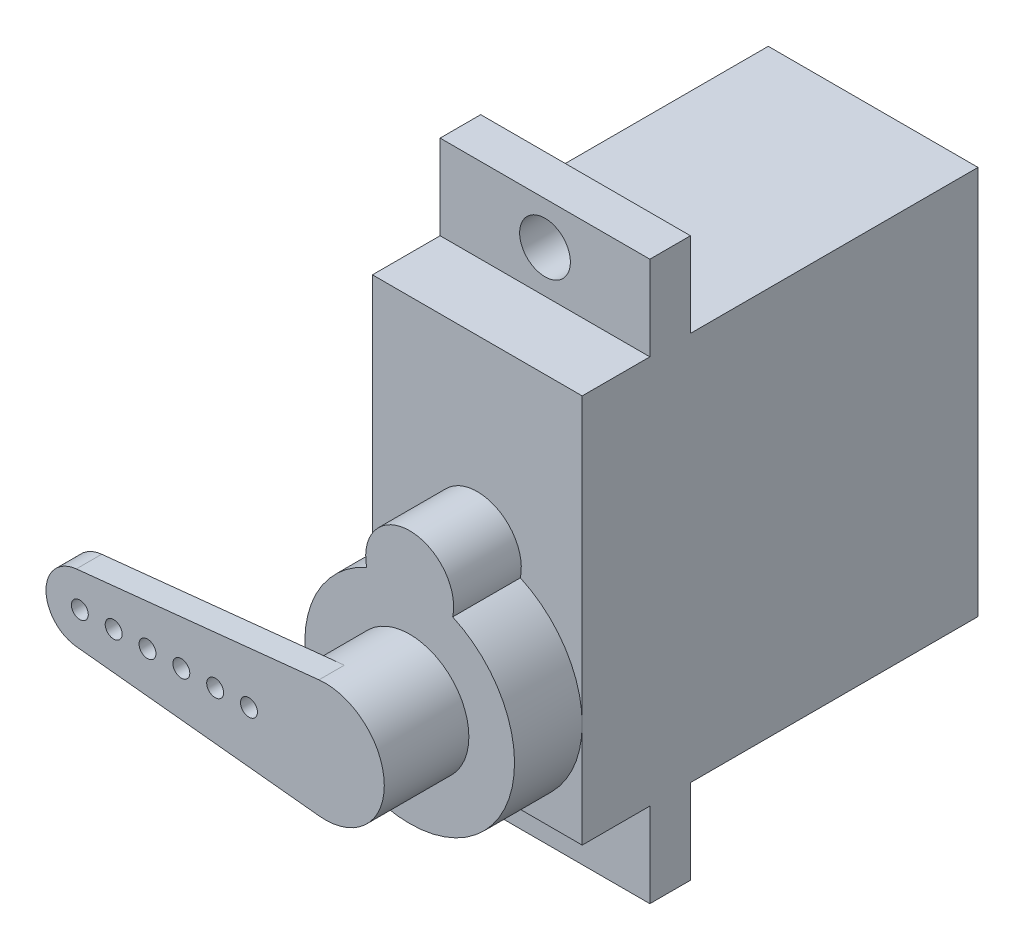
ISO-10303-21;
HEADER;
FILE_DESCRIPTION(('STEP AP214'),'2;1');
FILE_NAME('part.step','',(''),(''),'','','');
FILE_SCHEMA(('AUTOMOTIVE_DESIGN { 1 0 10303 214 1 1 1 1 }'));
ENDSEC;
DATA;
#1=APPLICATION_CONTEXT('core data for automotive mechanical design processes');
#2=APPLICATION_PROTOCOL_DEFINITION('international standard','automotive_design',2000,#1);
#3=PRODUCT_CONTEXT('',#1,'mechanical');
#4=PRODUCT('Part','Part','',(#3));
#5=PRODUCT_RELATED_PRODUCT_CATEGORY('part','',(#4));
#6=PRODUCT_DEFINITION_FORMATION('','',#4);
#7=PRODUCT_DEFINITION_CONTEXT('part definition',#1,'design');
#8=PRODUCT_DEFINITION('design','',#6,#7);
#9=PRODUCT_DEFINITION_SHAPE('','',#8);
#10=(LENGTH_UNIT() NAMED_UNIT(*) SI_UNIT(.MILLI.,.METRE.));
#11=(NAMED_UNIT(*) PLANE_ANGLE_UNIT() SI_UNIT($,.RADIAN.));
#12=(NAMED_UNIT(*) SI_UNIT($,.STERADIAN.) SOLID_ANGLE_UNIT());
#13=UNCERTAINTY_MEASURE_WITH_UNIT(LENGTH_MEASURE(1.E-05),#10,'distance_accuracy_value','');
#14=(GEOMETRIC_REPRESENTATION_CONTEXT(3) GLOBAL_UNCERTAINTY_ASSIGNED_CONTEXT((#13)) GLOBAL_UNIT_ASSIGNED_CONTEXT((#10,
#11,#12)) REPRESENTATION_CONTEXT('',''));
#15=CARTESIAN_POINT('',(0.,0.,0.));
#16=DIRECTION('',(0.,0.,1.));
#17=DIRECTION('',(1.,0.,0.));
#18=AXIS2_PLACEMENT_3D('',#15,#16,#17);
#19=CARTESIAN_POINT('',(6.2,11.5,0.));
#20=DIRECTION('',(0.,0.,1.));
#21=DIRECTION('',(1.,0.,0.));
#22=AXIS2_PLACEMENT_3D('',#19,#20,#21);
#23=PLANE('',#22);
#24=DIRECTION('',(0.,-1.,0.));
#25=VECTOR('',#24,1.);
#26=CARTESIAN_POINT('',(0.,23.,0.));
#27=LINE('',#26,#25);
#28=CARTESIAN_POINT('',(0.,23.,0.));
#29=VERTEX_POINT('',#28);
#30=CARTESIAN_POINT('',(0.,0.,0.));
#31=VERTEX_POINT('',#30);
#32=EDGE_CURVE('P0_E11',#29,#31,#27,.T.);
#33=ORIENTED_EDGE('',*,*,#32,.F.);
#34=DIRECTION('',(-1.,0.,0.));
#35=VECTOR('',#34,1.);
#36=CARTESIAN_POINT('',(12.4,23.,0.));
#37=LINE('',#36,#35);
#38=CARTESIAN_POINT('',(12.4,23.,0.));
#39=VERTEX_POINT('',#38);
#40=EDGE_CURVE('P0_E238',#39,#29,#37,.T.);
#41=ORIENTED_EDGE('',*,*,#40,.F.);
#42=DIRECTION('',(0.,1.,0.));
#43=VECTOR('',#42,1.);
#44=CARTESIAN_POINT('',(12.4,0.,0.));
#45=LINE('',#44,#43);
#46=CARTESIAN_POINT('',(12.4,0.,0.));
#47=VERTEX_POINT('',#46);
#48=EDGE_CURVE('P0_E352',#47,#39,#45,.T.);
#49=ORIENTED_EDGE('',*,*,#48,.F.);
#50=DIRECTION('',(1.,0.,0.));
#51=VECTOR('',#50,1.);
#52=CARTESIAN_POINT('',(0.,0.,0.));
#53=LINE('',#52,#51);
#54=EDGE_CURVE('P0_E43',#31,#47,#53,.T.);
#55=ORIENTED_EDGE('',*,*,#54,.F.);
#56=EDGE_LOOP('',(#33,#41,#49,#55));
#57=FACE_BOUND('',#56,.T.);
#58=ADVANCED_FACE('P0_F16',(#57),#23,.F.);
#59=CARTESIAN_POINT('',(0.,23.,0.));
#60=DIRECTION('',(-1.,0.,0.));
#61=DIRECTION('',(0.,0.,1.));
#62=AXIS2_PLACEMENT_3D('',#59,#60,#61);
#63=PLANE('',#62);
#64=ORIENTED_EDGE('',*,*,#32,.T.);
#65=DIRECTION('',(0.,0.,1.));
#66=VECTOR('',#65,1.);
#67=CARTESIAN_POINT('',(0.,0.,0.));
#68=LINE('',#67,#66);
#69=CARTESIAN_POINT('',(0.,0.,17.));
#70=VERTEX_POINT('',#69);
#71=EDGE_CURVE('P0_E24',#31,#70,#68,.T.);
#72=ORIENTED_EDGE('',*,*,#71,.T.);
#73=DIRECTION('',(0.,-1.,0.));
#74=VECTOR('',#73,1.);
#75=CARTESIAN_POINT('',(0.,23.,17.));
#76=LINE('',#75,#74);
#77=CARTESIAN_POINT('',(0.,-5.,17.));
#78=VERTEX_POINT('',#77);
#79=EDGE_CURVE('P0_E262',#70,#78,#76,.T.);
#80=ORIENTED_EDGE('',*,*,#79,.T.);
#81=DIRECTION('',(0.,0.,1.));
#82=VECTOR('',#81,1.);
#83=CARTESIAN_POINT('',(0.,-5.,17.));
#84=LINE('',#83,#82);
#85=CARTESIAN_POINT('',(0.,-5.,19.4));
#86=VERTEX_POINT('',#85);
#87=EDGE_CURVE('P0_E235',#78,#86,#84,.T.);
#88=ORIENTED_EDGE('',*,*,#87,.T.);
#89=DIRECTION('',(0.,-1.,0.));
#90=VECTOR('',#89,1.);
#91=CARTESIAN_POINT('',(0.,23.,19.4));
#92=LINE('',#91,#90);
#93=CARTESIAN_POINT('',(0.,0.,19.4));
#94=VERTEX_POINT('',#93);
#95=EDGE_CURVE('P0_E307',#94,#86,#92,.T.);
#96=ORIENTED_EDGE('',*,*,#95,.F.);
#97=DIRECTION('',(0.,0.,1.));
#98=VECTOR('',#97,1.);
#99=CARTESIAN_POINT('',(0.,0.,19.4));
#100=LINE('',#99,#98);
#101=CARTESIAN_POINT('',(0.,0.,23.4));
#102=VERTEX_POINT('',#101);
#103=EDGE_CURVE('P0_E294',#94,#102,#100,.T.);
#104=ORIENTED_EDGE('',*,*,#103,.T.);
#105=DIRECTION('',(0.,-1.,0.));
#106=VECTOR('',#105,1.);
#107=CARTESIAN_POINT('',(0.,23.,23.4));
#108=LINE('',#107,#106);
#109=CARTESIAN_POINT('',(0.,6.2,23.4));
#110=VERTEX_POINT('',#109);
#111=EDGE_CURVE('P0_E266',#110,#102,#108,.T.);
#112=ORIENTED_EDGE('',*,*,#111,.F.);
#113=DIRECTION('',(0.,-1.,0.));
#114=VECTOR('',#113,1.);
#115=CARTESIAN_POINT('',(0.,23.,23.4));
#116=LINE('',#115,#114);
#117=CARTESIAN_POINT('',(0.,23.,23.4));
#118=VERTEX_POINT('',#117);
#119=EDGE_CURVE('P0_E186',#118,#110,#116,.T.);
#120=ORIENTED_EDGE('',*,*,#119,.F.);
#121=DIRECTION('',(0.,0.,1.));
#122=VECTOR('',#121,1.);
#123=CARTESIAN_POINT('',(0.,23.,19.4));
#124=LINE('',#123,#122);
#125=CARTESIAN_POINT('',(0.,23.,19.4));
#126=VERTEX_POINT('',#125);
#127=EDGE_CURVE('P0_E281',#126,#118,#124,.T.);
#128=ORIENTED_EDGE('',*,*,#127,.F.);
#129=DIRECTION('',(0.,-1.,0.));
#130=VECTOR('',#129,1.);
#131=CARTESIAN_POINT('',(0.,23.,19.4));
#132=LINE('',#131,#130);
#133=CARTESIAN_POINT('',(0.,28.,19.4));
#134=VERTEX_POINT('',#133);
#135=EDGE_CURVE('P0_E304',#134,#126,#132,.T.);
#136=ORIENTED_EDGE('',*,*,#135,.F.);
#137=DIRECTION('',(0.,0.,1.));
#138=VECTOR('',#137,1.);
#139=CARTESIAN_POINT('',(0.,28.,17.));
#140=LINE('',#139,#138);
#141=CARTESIAN_POINT('',(0.,28.,17.));
#142=VERTEX_POINT('',#141);
#143=EDGE_CURVE('P0_E341',#142,#134,#140,.T.);
#144=ORIENTED_EDGE('',*,*,#143,.F.);
#145=DIRECTION('',(0.,-1.,0.));
#146=VECTOR('',#145,1.);
#147=CARTESIAN_POINT('',(0.,23.,17.));
#148=LINE('',#147,#146);
#149=CARTESIAN_POINT('',(0.,23.,17.));
#150=VERTEX_POINT('',#149);
#151=EDGE_CURVE('P0_E248',#142,#150,#148,.T.);
#152=ORIENTED_EDGE('',*,*,#151,.T.);
#153=DIRECTION('',(0.,0.,1.));
#154=VECTOR('',#153,1.);
#155=CARTESIAN_POINT('',(0.,23.,0.));
#156=LINE('',#155,#154);
#157=EDGE_CURVE('P0_E277',#29,#150,#156,.T.);
#158=ORIENTED_EDGE('',*,*,#157,.F.);
#159=EDGE_LOOP('',(#64,#72,#80,#88,#96,#104,#112,#120,#128,#136,#144,#152,#158));
#160=FACE_BOUND('',#159,.T.);
#161=ADVANCED_FACE('P0_F367',(#160),#63,.T.);
#162=CARTESIAN_POINT('',(0.,0.,0.));
#163=DIRECTION('',(0.,-1.,0.));
#164=DIRECTION('',(0.,0.,-1.));
#165=AXIS2_PLACEMENT_3D('',#162,#163,#164);
#166=PLANE('',#165);
#167=ORIENTED_EDGE('',*,*,#54,.T.);
#168=DIRECTION('',(0.,0.,1.));
#169=VECTOR('',#168,1.);
#170=CARTESIAN_POINT('',(12.4,0.,0.));
#171=LINE('',#170,#169);
#172=CARTESIAN_POINT('',(12.4,0.,17.));
#173=VERTEX_POINT('',#172);
#174=EDGE_CURVE('P0_E333',#47,#173,#171,.T.);
#175=ORIENTED_EDGE('',*,*,#174,.T.);
#176=DIRECTION('',(1.,0.,0.));
#177=VECTOR('',#176,1.);
#178=CARTESIAN_POINT('',(0.,0.,17.));
#179=LINE('',#178,#177);
#180=EDGE_CURVE('P0_E316',#70,#173,#179,.T.);
#181=ORIENTED_EDGE('',*,*,#180,.F.);
#182=ORIENTED_EDGE('',*,*,#71,.F.);
#183=EDGE_LOOP('',(#167,#175,#181,#182));
#184=FACE_BOUND('',#183,.T.);
#185=ADVANCED_FACE('P0_F357',(#184),#166,.T.);
#186=CARTESIAN_POINT('',(12.4,0.,0.));
#187=DIRECTION('',(1.,0.,0.));
#188=DIRECTION('',(0.,1.,0.));
#189=AXIS2_PLACEMENT_3D('',#186,#187,#188);
#190=PLANE('',#189);
#191=ORIENTED_EDGE('',*,*,#48,.T.);
#192=DIRECTION('',(0.,0.,1.));
#193=VECTOR('',#192,1.);
#194=CARTESIAN_POINT('',(12.4,23.,0.));
#195=LINE('',#194,#193);
#196=CARTESIAN_POINT('',(12.4,23.,17.));
#197=VERTEX_POINT('',#196);
#198=EDGE_CURVE('P0_E349',#39,#197,#195,.T.);
#199=ORIENTED_EDGE('',*,*,#198,.T.);
#200=DIRECTION('',(0.,1.,0.));
#201=VECTOR('',#200,1.);
#202=CARTESIAN_POINT('',(12.4,-5.,17.));
#203=LINE('',#202,#201);
#204=CARTESIAN_POINT('',(12.4,28.,17.));
#205=VERTEX_POINT('',#204);
#206=EDGE_CURVE('P0_E337',#197,#205,#203,.T.);
#207=ORIENTED_EDGE('',*,*,#206,.T.);
#208=DIRECTION('',(0.,0.,1.));
#209=VECTOR('',#208,1.);
#210=CARTESIAN_POINT('',(12.4,28.,17.));
#211=LINE('',#210,#209);
#212=CARTESIAN_POINT('',(12.4,28.,19.4));
#213=VERTEX_POINT('',#212);
#214=EDGE_CURVE('P0_E344',#205,#213,#211,.T.);
#215=ORIENTED_EDGE('',*,*,#214,.T.);
#216=DIRECTION('',(0.,1.,0.));
#217=VECTOR('',#216,1.);
#218=CARTESIAN_POINT('',(12.4,-5.,19.4));
#219=LINE('',#218,#217);
#220=CARTESIAN_POINT('',(12.4,23.,19.4));
#221=VERTEX_POINT('',#220);
#222=EDGE_CURVE('P0_E297',#221,#213,#219,.T.);
#223=ORIENTED_EDGE('',*,*,#222,.F.);
#224=DIRECTION('',(0.,0.,1.));
#225=VECTOR('',#224,1.);
#226=CARTESIAN_POINT('',(12.4,23.,19.4));
#227=LINE('',#226,#225);
#228=CARTESIAN_POINT('',(12.4,23.,23.4));
#229=VERTEX_POINT('',#228);
#230=EDGE_CURVE('P0_E284',#221,#229,#227,.T.);
#231=ORIENTED_EDGE('',*,*,#230,.T.);
#232=DIRECTION('',(0.,1.,0.));
#233=VECTOR('',#232,1.);
#234=CARTESIAN_POINT('',(12.4,0.,23.4));
#235=LINE('',#234,#233);
#236=CARTESIAN_POINT('',(12.4,6.2,23.4));
#237=VERTEX_POINT('',#236);
#238=EDGE_CURVE('P0_E225',#237,#229,#235,.T.);
#239=ORIENTED_EDGE('',*,*,#238,.F.);
#240=DIRECTION('',(0.,1.,0.));
#241=VECTOR('',#240,1.);
#242=CARTESIAN_POINT('',(12.4,0.,23.4));
#243=LINE('',#242,#241);
#244=CARTESIAN_POINT('',(12.4,0.,23.4));
#245=VERTEX_POINT('',#244);
#246=EDGE_CURVE('P0_E257',#245,#237,#243,.T.);
#247=ORIENTED_EDGE('',*,*,#246,.F.);
#248=DIRECTION('',(0.,0.,1.));
#249=VECTOR('',#248,1.);
#250=CARTESIAN_POINT('',(12.4,0.,19.4));
#251=LINE('',#250,#249);
#252=CARTESIAN_POINT('',(12.4,0.,19.4));
#253=VERTEX_POINT('',#252);
#254=EDGE_CURVE('P0_E291',#253,#245,#251,.T.);
#255=ORIENTED_EDGE('',*,*,#254,.F.);
#256=DIRECTION('',(0.,1.,0.));
#257=VECTOR('',#256,1.);
#258=CARTESIAN_POINT('',(12.4,-5.,19.4));
#259=LINE('',#258,#257);
#260=CARTESIAN_POINT('',(12.4,-5.,19.4));
#261=VERTEX_POINT('',#260);
#262=EDGE_CURVE('P0_E315',#261,#253,#259,.T.);
#263=ORIENTED_EDGE('',*,*,#262,.F.);
#264=DIRECTION('',(0.,0.,1.));
#265=VECTOR('',#264,1.);
#266=CARTESIAN_POINT('',(12.4,-5.,17.));
#267=LINE('',#266,#265);
#268=CARTESIAN_POINT('',(12.4,-5.,17.));
#269=VERTEX_POINT('',#268);
#270=EDGE_CURVE('P0_E239',#269,#261,#267,.T.);
#271=ORIENTED_EDGE('',*,*,#270,.F.);
#272=DIRECTION('',(0.,1.,0.));
#273=VECTOR('',#272,1.);
#274=CARTESIAN_POINT('',(12.4,-5.,17.));
#275=LINE('',#274,#273);
#276=EDGE_CURVE('P0_E263',#269,#173,#275,.T.);
#277=ORIENTED_EDGE('',*,*,#276,.T.);
#278=ORIENTED_EDGE('',*,*,#174,.F.);
#279=EDGE_LOOP('',(#191,#199,#207,#215,#223,#231,#239,#247,#255,#263,#271,#277,#278));
#280=FACE_BOUND('',#279,.T.);
#281=ADVANCED_FACE('P0_F361',(#280),#190,.T.);
#282=CARTESIAN_POINT('',(12.4,23.,0.));
#283=DIRECTION('',(0.,1.,0.));
#284=DIRECTION('',(1.,0.,0.));
#285=AXIS2_PLACEMENT_3D('',#282,#283,#284);
#286=PLANE('',#285);
#287=ORIENTED_EDGE('',*,*,#40,.T.);
#288=ORIENTED_EDGE('',*,*,#157,.T.);
#289=DIRECTION('',(-1.,0.,0.));
#290=VECTOR('',#289,1.);
#291=CARTESIAN_POINT('',(12.4,23.,17.));
#292=LINE('',#291,#290);
#293=EDGE_CURVE('P0_E253',#197,#150,#292,.T.);
#294=ORIENTED_EDGE('',*,*,#293,.F.);
#295=ORIENTED_EDGE('',*,*,#198,.F.);
#296=EDGE_LOOP('',(#287,#288,#294,#295));
#297=FACE_BOUND('',#296,.T.);
#298=ADVANCED_FACE('P0_F375',(#297),#286,.T.);
#299=CARTESIAN_POINT('',(0.,-5.,17.));
#300=DIRECTION('',(0.,-1.,0.));
#301=DIRECTION('',(0.,0.,-1.));
#302=AXIS2_PLACEMENT_3D('',#299,#300,#301);
#303=PLANE('',#302);
#304=DIRECTION('',(1.,0.,0.));
#305=VECTOR('',#304,1.);
#306=CARTESIAN_POINT('',(0.,-5.,17.));
#307=LINE('',#306,#305);
#308=EDGE_CURVE('P0_E258',#78,#269,#307,.T.);
#309=ORIENTED_EDGE('',*,*,#308,.T.);
#310=ORIENTED_EDGE('',*,*,#270,.T.);
#311=DIRECTION('',(1.,0.,0.));
#312=VECTOR('',#311,1.);
#313=CARTESIAN_POINT('',(0.,-5.,19.4));
#314=LINE('',#313,#312);
#315=EDGE_CURVE('P0_E311',#86,#261,#314,.T.);
#316=ORIENTED_EDGE('',*,*,#315,.F.);
#317=ORIENTED_EDGE('',*,*,#87,.F.);
#318=EDGE_LOOP('',(#309,#310,#316,#317));
#319=FACE_BOUND('',#318,.T.);
#320=ADVANCED_FACE('P0_F448',(#319),#303,.T.);
#321=CARTESIAN_POINT('',(12.4,28.,17.));
#322=DIRECTION('',(0.,1.,0.));
#323=DIRECTION('',(1.,0.,0.));
#324=AXIS2_PLACEMENT_3D('',#321,#322,#323);
#325=PLANE('',#324);
#326=DIRECTION('',(1.,0.,0.));
#327=VECTOR('',#326,1.);
#328=CARTESIAN_POINT('',(0.,28.,17.));
#329=LINE('',#328,#327);
#330=EDGE_CURVE('P0_E252',#142,#205,#329,.T.);
#331=ORIENTED_EDGE('',*,*,#330,.F.);
#332=ORIENTED_EDGE('',*,*,#143,.T.);
#333=DIRECTION('',(-1.,0.,0.));
#334=VECTOR('',#333,1.);
#335=CARTESIAN_POINT('',(0.,28.,19.4));
#336=LINE('',#335,#334);
#337=EDGE_CURVE('P0_E301',#213,#134,#336,.T.);
#338=ORIENTED_EDGE('',*,*,#337,.F.);
#339=ORIENTED_EDGE('',*,*,#214,.F.);
#340=EDGE_LOOP('',(#331,#332,#338,#339));
#341=FACE_BOUND('',#340,.T.);
#342=ADVANCED_FACE('P0_F386',(#341),#325,.T.);
#343=CARTESIAN_POINT('',(6.2,11.5,17.));
#344=DIRECTION('',(0.,0.,1.));
#345=DIRECTION('',(1.,0.,0.));
#346=AXIS2_PLACEMENT_3D('',#343,#344,#345);
#347=PLANE('',#346);
#348=CARTESIAN_POINT('',(6.2,25.5,17.));
#349=DIRECTION('',(0.,0.,1.));
#350=DIRECTION('',(1.,0.,0.));
#351=AXIS2_PLACEMENT_3D('',#348,#349,#350);
#352=CIRCLE('',#351,1.5);
#353=CARTESIAN_POINT('',(4.7,25.5,17.));
#354=VERTEX_POINT('',#353);
#355=EDGE_CURVE('P0_E206',#354,#354,#352,.T.);
#356=ORIENTED_EDGE('',*,*,#355,.T.);
#357=EDGE_LOOP('',(#356));
#358=FACE_BOUND('',#357,.T.);
#359=ORIENTED_EDGE('',*,*,#293,.T.);
#360=ORIENTED_EDGE('',*,*,#151,.F.);
#361=ORIENTED_EDGE('',*,*,#330,.T.);
#362=ORIENTED_EDGE('',*,*,#206,.F.);
#363=EDGE_LOOP('',(#359,#360,#361,#362));
#364=FACE_BOUND('',#363,.T.);
#365=ADVANCED_FACE('P0_F378',(#358,#364),#347,.F.);
#366=CARTESIAN_POINT('',(6.2,11.5,17.));
#367=DIRECTION('',(0.,0.,1.));
#368=DIRECTION('',(1.,0.,0.));
#369=AXIS2_PLACEMENT_3D('',#366,#367,#368);
#370=PLANE('',#369);
#371=CARTESIAN_POINT('',(6.2,-2.5,17.));
#372=DIRECTION('',(0.,0.,1.));
#373=DIRECTION('',(1.,0.,0.));
#374=AXIS2_PLACEMENT_3D('',#371,#372,#373);
#375=CIRCLE('',#374,1.5);
#376=CARTESIAN_POINT('',(4.7,-2.5,17.));
#377=VERTEX_POINT('',#376);
#378=EDGE_CURVE('P0_E404',#377,#377,#375,.T.);
#379=ORIENTED_EDGE('',*,*,#378,.T.);
#380=EDGE_LOOP('',(#379));
#381=FACE_BOUND('',#380,.T.);
#382=ORIENTED_EDGE('',*,*,#180,.T.);
#383=ORIENTED_EDGE('',*,*,#276,.F.);
#384=ORIENTED_EDGE('',*,*,#308,.F.);
#385=ORIENTED_EDGE('',*,*,#79,.F.);
#386=EDGE_LOOP('',(#382,#383,#384,#385));
#387=FACE_BOUND('',#386,.T.);
#388=ADVANCED_FACE('P0_F366',(#381,#387),#370,.F.);
#389=CARTESIAN_POINT('',(6.2,11.5,19.4));
#390=DIRECTION('',(0.,0.,1.));
#391=DIRECTION('',(1.,0.,0.));
#392=AXIS2_PLACEMENT_3D('',#389,#390,#391);
#393=PLANE('',#392);
#394=CARTESIAN_POINT('',(6.2,-2.5,19.4));
#395=DIRECTION('',(0.,0.,-1.));
#396=DIRECTION('',(1.,0.,0.));
#397=AXIS2_PLACEMENT_3D('',#394,#395,#396);
#398=CIRCLE('',#397,1.5);
#399=CARTESIAN_POINT('',(4.7,-2.5,19.4));
#400=VERTEX_POINT('',#399);
#401=EDGE_CURVE('P0_E410',#400,#400,#398,.T.);
#402=ORIENTED_EDGE('',*,*,#401,.T.);
#403=EDGE_LOOP('',(#402));
#404=FACE_BOUND('',#403,.T.);
#405=DIRECTION('',(-1.,0.,0.));
#406=VECTOR('',#405,1.);
#407=CARTESIAN_POINT('',(3.1,0.,19.4));
#408=LINE('',#407,#406);
#409=EDGE_CURVE('P0_E287',#253,#94,#408,.T.);
#410=ORIENTED_EDGE('',*,*,#409,.T.);
#411=ORIENTED_EDGE('',*,*,#95,.T.);
#412=ORIENTED_EDGE('',*,*,#315,.T.);
#413=ORIENTED_EDGE('',*,*,#262,.T.);
#414=EDGE_LOOP('',(#410,#411,#412,#413));
#415=FACE_BOUND('',#414,.T.);
#416=ADVANCED_FACE('P0_F419',(#404,#415),#393,.T.);
#417=CARTESIAN_POINT('',(6.2,11.5,19.4));
#418=DIRECTION('',(0.,0.,1.));
#419=DIRECTION('',(1.,0.,0.));
#420=AXIS2_PLACEMENT_3D('',#417,#418,#419);
#421=PLANE('',#420);
#422=CARTESIAN_POINT('',(6.2,25.5,19.4));
#423=DIRECTION('',(0.,0.,-1.));
#424=DIRECTION('',(1.,0.,0.));
#425=AXIS2_PLACEMENT_3D('',#422,#423,#424);
#426=CIRCLE('',#425,1.5);
#427=CARTESIAN_POINT('',(4.7,25.5,19.4));
#428=VERTEX_POINT('',#427);
#429=EDGE_CURVE('P0_E215',#428,#428,#426,.T.);
#430=ORIENTED_EDGE('',*,*,#429,.T.);
#431=EDGE_LOOP('',(#430));
#432=FACE_BOUND('',#431,.T.);
#433=DIRECTION('',(1.,0.,0.));
#434=VECTOR('',#433,1.);
#435=CARTESIAN_POINT('',(9.3,23.,19.4));
#436=LINE('',#435,#434);
#437=EDGE_CURVE('P0_E273',#126,#221,#436,.T.);
#438=ORIENTED_EDGE('',*,*,#437,.T.);
#439=ORIENTED_EDGE('',*,*,#222,.T.);
#440=ORIENTED_EDGE('',*,*,#337,.T.);
#441=ORIENTED_EDGE('',*,*,#135,.T.);
#442=EDGE_LOOP('',(#438,#439,#440,#441));
#443=FACE_BOUND('',#442,.T.);
#444=ADVANCED_FACE('P0_F390',(#432,#443),#421,.T.);
#445=CARTESIAN_POINT('',(0.,0.,19.4));
#446=DIRECTION('',(0.,-1.,0.));
#447=DIRECTION('',(0.,0.,-1.));
#448=AXIS2_PLACEMENT_3D('',#445,#446,#447);
#449=PLANE('',#448);
#450=ORIENTED_EDGE('',*,*,#409,.F.);
#451=ORIENTED_EDGE('',*,*,#254,.T.);
#452=DIRECTION('',(1.,0.,0.));
#453=VECTOR('',#452,1.);
#454=CARTESIAN_POINT('',(0.,0.,23.4));
#455=LINE('',#454,#453);
#456=CARTESIAN_POINT('',(6.2,0.,23.4));
#457=VERTEX_POINT('',#456);
#458=EDGE_CURVE('P0_E247',#457,#245,#455,.T.);
#459=ORIENTED_EDGE('',*,*,#458,.F.);
#460=DIRECTION('',(1.,0.,0.));
#461=VECTOR('',#460,1.);
#462=CARTESIAN_POINT('',(0.,0.,23.4));
#463=LINE('',#462,#461);
#464=EDGE_CURVE('P0_E270',#102,#457,#463,.T.);
#465=ORIENTED_EDGE('',*,*,#464,.F.);
#466=ORIENTED_EDGE('',*,*,#103,.F.);
#467=EDGE_LOOP('',(#450,#451,#459,#465,#466));
#468=FACE_BOUND('',#467,.T.);
#469=ADVANCED_FACE('P0_F452',(#468),#449,.T.);
#470=CARTESIAN_POINT('',(12.4,23.,19.4));
#471=DIRECTION('',(0.,1.,0.));
#472=DIRECTION('',(1.,0.,0.));
#473=AXIS2_PLACEMENT_3D('',#470,#471,#472);
#474=PLANE('',#473);
#475=ORIENTED_EDGE('',*,*,#437,.F.);
#476=ORIENTED_EDGE('',*,*,#127,.T.);
#477=DIRECTION('',(-1.,0.,0.));
#478=VECTOR('',#477,1.);
#479=CARTESIAN_POINT('',(12.4,23.,23.4));
#480=LINE('',#479,#478);
#481=EDGE_CURVE('P0_E229',#229,#118,#480,.T.);
#482=ORIENTED_EDGE('',*,*,#481,.F.);
#483=ORIENTED_EDGE('',*,*,#230,.F.);
#484=EDGE_LOOP('',(#475,#476,#482,#483));
#485=FACE_BOUND('',#484,.T.);
#486=ADVANCED_FACE('P0_F394',(#485),#474,.T.);
#487=CARTESIAN_POINT('',(6.2,11.5,23.4));
#488=DIRECTION('',(0.,0.,1.));
#489=DIRECTION('',(1.,0.,0.));
#490=AXIS2_PLACEMENT_3D('',#487,#488,#489);
#491=PLANE('',#490);
#492=CARTESIAN_POINT('',(6.2,6.2,23.4));
#493=DIRECTION('',(0.,0.,-1.));
#494=DIRECTION('',(-1.,0.,0.));
#495=AXIS2_PLACEMENT_3D('',#492,#493,#494);
#496=CIRCLE('',#495,6.2);
#497=EDGE_CURVE('P0_E234',#457,#110,#496,.T.);
#498=ORIENTED_EDGE('',*,*,#497,.T.);
#499=ORIENTED_EDGE('',*,*,#111,.T.);
#500=ORIENTED_EDGE('',*,*,#464,.T.);
#501=EDGE_LOOP('',(#498,#499,#500));
#502=FACE_BOUND('',#501,.T.);
#503=ADVANCED_FACE('P0_F456',(#502),#491,.T.);
#504=CARTESIAN_POINT('',(6.2,11.5,23.4));
#505=DIRECTION('',(0.,0.,1.));
#506=DIRECTION('',(1.,0.,0.));
#507=AXIS2_PLACEMENT_3D('',#504,#505,#506);
#508=PLANE('',#507);
#509=CARTESIAN_POINT('',(6.2,6.2,23.4));
#510=DIRECTION('',(0.,0.,-1.));
#511=DIRECTION('',(-1.,0.,0.));
#512=AXIS2_PLACEMENT_3D('',#509,#510,#511);
#513=CIRCLE('',#512,6.2);
#514=EDGE_CURVE('P0_E243',#237,#457,#513,.T.);
#515=ORIENTED_EDGE('',*,*,#514,.T.);
#516=ORIENTED_EDGE('',*,*,#458,.T.);
#517=ORIENTED_EDGE('',*,*,#246,.T.);
#518=EDGE_LOOP('',(#515,#516,#517));
#519=FACE_BOUND('',#518,.T.);
#520=ADVANCED_FACE('P0_F459',(#519),#508,.T.);
#521=CARTESIAN_POINT('',(6.2,6.2,27.4));
#522=DIRECTION('',(0.,0.,1.));
#523=DIRECTION('',(1.,0.,0.));
#524=AXIS2_PLACEMENT_3D('',#521,#522,#523);
#525=PLANE('',#524);
#526=CARTESIAN_POINT('',(6.2,6.2,27.4));
#527=DIRECTION('',(0.,0.,1.));
#528=DIRECTION('',(-1.,0.,0.));
#529=AXIS2_PLACEMENT_3D('',#526,#527,#528);
#530=CIRCLE('',#529,6.2);
#531=CARTESIAN_POINT('',(3.65779639534246,11.8548387096774,27.4));
#532=VERTEX_POINT('',#531);
#533=CARTESIAN_POINT('',(8.74220360465755,11.8548387096774,27.4));
#534=VERTEX_POINT('',#533);
#535=EDGE_CURVE('P0_E190',#532,#534,#530,.T.);
#536=ORIENTED_EDGE('',*,*,#535,.T.);
#537=CARTESIAN_POINT('',(6.2,12.4,27.4));
#538=DIRECTION('',(0.,0.,1.));
#539=DIRECTION('',(-1.,0.,0.));
#540=AXIS2_PLACEMENT_3D('',#537,#538,#539);
#541=CIRCLE('',#540,2.6);
#542=EDGE_CURVE('P0_E200',#534,#532,#541,.T.);
#543=ORIENTED_EDGE('',*,*,#542,.T.);
#544=EDGE_LOOP('',(#536,#543));
#545=FACE_BOUND('',#544,.T.);
#546=ADVANCED_FACE('P0_F466',(#545),#525,.T.);
#547=CARTESIAN_POINT('',(6.2,6.2,23.4));
#548=DIRECTION('',(0.,0.,1.));
#549=DIRECTION('',(0.,-1.,0.));
#550=AXIS2_PLACEMENT_3D('',#547,#548,#549);
#551=CYLINDRICAL_SURFACE('',#550,6.2);
#552=DIRECTION('',(0.,0.,1.));
#553=VECTOR('',#552,1.);
#554=CARTESIAN_POINT('',(8.74220360465755,11.8548387096774,23.4));
#555=LINE('',#554,#553);
#556=CARTESIAN_POINT('',(8.74220360465755,11.8548387096774,23.4));
#557=VERTEX_POINT('',#556);
#558=EDGE_CURVE('P0_E204',#557,#534,#555,.T.);
#559=ORIENTED_EDGE('',*,*,#558,.T.);
#560=ORIENTED_EDGE('',*,*,#535,.F.);
#561=DIRECTION('',(0.,0.,-1.));
#562=VECTOR('',#561,1.);
#563=CARTESIAN_POINT('',(3.65779639534246,11.8548387096774,23.4));
#564=LINE('',#563,#562);
#565=CARTESIAN_POINT('',(3.65779639534246,11.8548387096774,23.4));
#566=VERTEX_POINT('',#565);
#567=EDGE_CURVE('P0_E193',#532,#566,#564,.T.);
#568=ORIENTED_EDGE('',*,*,#567,.T.);
#569=CARTESIAN_POINT('',(6.2,6.2,23.4));
#570=DIRECTION('',(0.,0.,-1.));
#571=DIRECTION('',(-1.,0.,0.));
#572=AXIS2_PLACEMENT_3D('',#569,#570,#571);
#573=CIRCLE('',#572,6.2);
#574=EDGE_CURVE('P0_E178',#110,#566,#573,.T.);
#575=ORIENTED_EDGE('',*,*,#574,.F.);
#576=ORIENTED_EDGE('',*,*,#497,.F.);
#577=ORIENTED_EDGE('',*,*,#514,.F.);
#578=CARTESIAN_POINT('',(6.2,6.2,23.4));
#579=DIRECTION('',(0.,0.,-1.));
#580=DIRECTION('',(-1.,0.,0.));
#581=AXIS2_PLACEMENT_3D('',#578,#579,#580);
#582=CIRCLE('',#581,6.2);
#583=EDGE_CURVE('P0_E223',#557,#237,#582,.T.);
#584=ORIENTED_EDGE('',*,*,#583,.F.);
#585=EDGE_LOOP('',(#559,#560,#568,#575,#576,#577,#584));
#586=FACE_BOUND('',#585,.T.);
#587=ADVANCED_FACE('P0_F195',(#586),#551,.T.);
#588=CARTESIAN_POINT('',(6.2,11.5,23.4));
#589=DIRECTION('',(0.,0.,1.));
#590=DIRECTION('',(1.,0.,0.));
#591=AXIS2_PLACEMENT_3D('',#588,#589,#590);
#592=PLANE('',#591);
#593=CARTESIAN_POINT('',(6.2,12.4,23.4));
#594=DIRECTION('',(0.,0.,-1.));
#595=DIRECTION('',(-1.,0.,0.));
#596=AXIS2_PLACEMENT_3D('',#593,#594,#595);
#597=CIRCLE('',#596,2.6);
#598=EDGE_CURVE('P0_E183',#566,#557,#597,.T.);
#599=ORIENTED_EDGE('',*,*,#598,.T.);
#600=ORIENTED_EDGE('',*,*,#583,.T.);
#601=ORIENTED_EDGE('',*,*,#238,.T.);
#602=ORIENTED_EDGE('',*,*,#481,.T.);
#603=ORIENTED_EDGE('',*,*,#119,.T.);
#604=ORIENTED_EDGE('',*,*,#574,.T.);
#605=EDGE_LOOP('',(#599,#600,#601,#602,#603,#604));
#606=FACE_BOUND('',#605,.T.);
#607=ADVANCED_FACE('P0_F180',(#606),#592,.T.);
#608=CARTESIAN_POINT('',(6.2,12.4,23.4));
#609=DIRECTION('',(0.,0.,1.));
#610=DIRECTION('',(0.,1.,0.));
#611=AXIS2_PLACEMENT_3D('',#608,#609,#610);
#612=CYLINDRICAL_SURFACE('',#611,2.6);
#613=ORIENTED_EDGE('',*,*,#598,.F.);
#614=ORIENTED_EDGE('',*,*,#567,.F.);
#615=ORIENTED_EDGE('',*,*,#542,.F.);
#616=ORIENTED_EDGE('',*,*,#558,.F.);
#617=EDGE_LOOP('',(#613,#614,#615,#616));
#618=FACE_BOUND('',#617,.T.);
#619=ADVANCED_FACE('P0_F203',(#618),#612,.T.);
#620=CARTESIAN_POINT('',(6.2,25.5,18.08));
#621=DIRECTION('',(0.,0.,-1.));
#622=DIRECTION('',(1.,0.,0.));
#623=AXIS2_PLACEMENT_3D('',#620,#621,#622);
#624=CYLINDRICAL_SURFACE('',#623,1.5);
#625=ORIENTED_EDGE('',*,*,#429,.F.);
#626=DIRECTION('',(0.,0.,-1.));
#627=VECTOR('',#626,1.);
#628=CARTESIAN_POINT('',(4.7,25.5,18.08));
#629=LINE('',#628,#627);
#630=EDGE_CURVE('P0_E211',#428,#354,#629,.T.);
#631=ORIENTED_EDGE('',*,*,#630,.T.);
#632=ORIENTED_EDGE('',*,*,#355,.F.);
#633=ORIENTED_EDGE('',*,*,#630,.F.);
#634=EDGE_LOOP('',(#625,#631,#632,#633));
#635=FACE_BOUND('',#634,.T.);
#636=ADVANCED_FACE('P0_F477',(#635),#624,.F.);
#637=CARTESIAN_POINT('',(6.2,-2.5,18.08));
#638=DIRECTION('',(0.,0.,-1.));
#639=DIRECTION('',(1.,0.,0.));
#640=AXIS2_PLACEMENT_3D('',#637,#638,#639);
#641=CYLINDRICAL_SURFACE('',#640,1.5);
#642=ORIENTED_EDGE('',*,*,#401,.F.);
#643=DIRECTION('',(0.,0.,-1.));
#644=VECTOR('',#643,1.);
#645=CARTESIAN_POINT('',(4.7,-2.5,18.08));
#646=LINE('',#645,#644);
#647=EDGE_CURVE('P0_E407',#400,#377,#646,.T.);
#648=ORIENTED_EDGE('',*,*,#647,.T.);
#649=ORIENTED_EDGE('',*,*,#378,.F.);
#650=ORIENTED_EDGE('',*,*,#647,.F.);
#651=EDGE_LOOP('',(#642,#648,#649,#650));
#652=FACE_BOUND('',#651,.T.);
#653=ADVANCED_FACE('P0_F422',(#652),#641,.F.);
#654=CLOSED_SHELL('',(#58,#161,#185,#281,#298,#320,#342,#365,#388,#416,#444,#469,#486,#503,#520,
#546,#587,#607,#619,#636,#653));
#655=MANIFOLD_SOLID_BREP('P0_B1',#654);
#656=CARTESIAN_POINT('',(6.2,6.2,27.4));
#657=DIRECTION('',(0.,0.,1.));
#658=DIRECTION('',(1.,0.,0.));
#659=AXIS2_PLACEMENT_3D('',#656,#657,#658);
#660=PLANE('',#659);
#661=CARTESIAN_POINT('',(6.2,6.2,27.4));
#662=DIRECTION('',(0.,0.,1.));
#663=DIRECTION('',(-1.,0.,0.));
#664=AXIS2_PLACEMENT_3D('',#661,#662,#663);
#665=CIRCLE('',#664,3.5);
#666=CARTESIAN_POINT('',(9.7,6.2,27.4));
#667=VERTEX_POINT('',#666);
#668=EDGE_CURVE('P1_E25',#667,#667,#665,.T.);
#669=ORIENTED_EDGE('',*,*,#668,.F.);
#670=EDGE_LOOP('',(#669));
#671=FACE_BOUND('',#670,.T.);
#672=ADVANCED_FACE('P1_F16',(#671),#660,.F.);
#673=CARTESIAN_POINT('',(6.2,6.2,32.4));
#674=DIRECTION('',(0.,0.,1.));
#675=DIRECTION('',(1.,0.,0.));
#676=AXIS2_PLACEMENT_3D('',#673,#674,#675);
#677=PLANE('',#676);
#678=CARTESIAN_POINT('',(-8.3,6.2,32.4));
#679=DIRECTION('',(0.,0.,-1.));
#680=DIRECTION('',(1.,0.,0.));
#681=AXIS2_PLACEMENT_3D('',#678,#679,#680);
#682=CIRCLE('',#681,0.5);
#683=CARTESIAN_POINT('',(-8.8,6.2,32.4));
#684=VERTEX_POINT('',#683);
#685=EDGE_CURVE('P1_E157',#684,#684,#682,.T.);
#686=ORIENTED_EDGE('',*,*,#685,.T.);
#687=EDGE_LOOP('',(#686));
#688=FACE_BOUND('',#687,.T.);
#689=CARTESIAN_POINT('',(-4.3,6.2,32.4));
#690=DIRECTION('',(0.,0.,-1.));
#691=DIRECTION('',(1.,0.,0.));
#692=AXIS2_PLACEMENT_3D('',#689,#690,#691);
#693=CIRCLE('',#692,0.5);
#694=CARTESIAN_POINT('',(-4.8,6.2,32.4));
#695=VERTEX_POINT('',#694);
#696=EDGE_CURVE('P1_E187',#695,#695,#693,.T.);
#697=ORIENTED_EDGE('',*,*,#696,.T.);
#698=EDGE_LOOP('',(#697));
#699=FACE_BOUND('',#698,.T.);
#700=CARTESIAN_POINT('',(-0.3,6.2,32.4));
#701=DIRECTION('',(0.,0.,-1.));
#702=DIRECTION('',(1.,0.,0.));
#703=AXIS2_PLACEMENT_3D('',#700,#701,#702);
#704=CIRCLE('',#703,0.5);
#705=CARTESIAN_POINT('',(-0.8,6.2,32.4));
#706=VERTEX_POINT('',#705);
#707=EDGE_CURVE('P1_E172',#706,#706,#704,.T.);
#708=ORIENTED_EDGE('',*,*,#707,.T.);
#709=EDGE_LOOP('',(#708));
#710=FACE_BOUND('',#709,.T.);
#711=CARTESIAN_POINT('',(1.7,6.2,32.4));
#712=DIRECTION('',(0.,0.,-1.));
#713=DIRECTION('',(1.,0.,0.));
#714=AXIS2_PLACEMENT_3D('',#711,#712,#713);
#715=CIRCLE('',#714,0.5);
#716=CARTESIAN_POINT('',(1.2,6.2,32.4));
#717=VERTEX_POINT('',#716);
#718=EDGE_CURVE('P1_E148',#717,#717,#715,.T.);
#719=ORIENTED_EDGE('',*,*,#718,.T.);
#720=EDGE_LOOP('',(#719));
#721=FACE_BOUND('',#720,.T.);
#722=CARTESIAN_POINT('',(-2.3,6.2,32.4));
#723=DIRECTION('',(0.,0.,-1.));
#724=DIRECTION('',(1.,0.,0.));
#725=AXIS2_PLACEMENT_3D('',#722,#723,#724);
#726=CIRCLE('',#725,0.5);
#727=CARTESIAN_POINT('',(-2.8,6.2,32.4));
#728=VERTEX_POINT('',#727);
#729=EDGE_CURVE('P1_E143',#728,#728,#726,.T.);
#730=ORIENTED_EDGE('',*,*,#729,.T.);
#731=EDGE_LOOP('',(#730));
#732=FACE_BOUND('',#731,.T.);
#733=CARTESIAN_POINT('',(-6.3,6.2,32.4));
#734=DIRECTION('',(0.,0.,-1.));
#735=DIRECTION('',(1.,0.,0.));
#736=AXIS2_PLACEMENT_3D('',#733,#734,#735);
#737=CIRCLE('',#736,0.5);
#738=CARTESIAN_POINT('',(-6.8,6.2,32.4));
#739=VERTEX_POINT('',#738);
#740=EDGE_CURVE('P1_E129',#739,#739,#737,.T.);
#741=ORIENTED_EDGE('',*,*,#740,.T.);
#742=EDGE_LOOP('',(#741));
#743=FACE_BOUND('',#742,.T.);
#744=CARTESIAN_POINT('',(6.2,6.2,32.4));
#745=DIRECTION('',(0.,0.,1.));
#746=DIRECTION('',(-1.,0.,0.));
#747=AXIS2_PLACEMENT_3D('',#744,#745,#746);
#748=CIRCLE('',#747,3.5);
#749=CARTESIAN_POINT('',(5.83793103448276,2.71877807885627,32.4));
#750=VERTEX_POINT('',#749);
#751=CARTESIAN_POINT('',(9.7,6.2,32.4));
#752=VERTEX_POINT('',#751);
#753=EDGE_CURVE('P1_E11',#750,#752,#748,.T.);
#754=ORIENTED_EDGE('',*,*,#753,.T.);
#755=CARTESIAN_POINT('',(6.2,6.2,32.4));
#756=DIRECTION('',(0.,0.,1.));
#757=DIRECTION('',(-1.,0.,0.));
#758=AXIS2_PLACEMENT_3D('',#755,#756,#757);
#759=CIRCLE('',#758,3.5);
#760=CARTESIAN_POINT('',(5.83793103448276,9.68122192114373,32.4));
#761=VERTEX_POINT('',#760);
#762=EDGE_CURVE('P1_E235',#752,#761,#759,.T.);
#763=ORIENTED_EDGE('',*,*,#762,.T.);
#764=DIRECTION('',(-0.994634834610737,-0.103448275862248,0.));
#765=VECTOR('',#764,1.);
#766=CARTESIAN_POINT('',(5.83793103448276,9.68122192114373,32.4));
#767=LINE('',#766,#765);
#768=CARTESIAN_POINT('',(-8.50689655172414,8.18926966922499,32.4));
#769=VERTEX_POINT('',#768);
#770=EDGE_CURVE('P1_E200',#761,#769,#767,.T.);
#771=ORIENTED_EDGE('',*,*,#770,.T.);
#772=CARTESIAN_POINT('',(-8.3,6.2,32.4));
#773=DIRECTION('',(0.,0.,1.));
#774=DIRECTION('',(-1.,0.,0.));
#775=AXIS2_PLACEMENT_3D('',#772,#773,#774);
#776=CIRCLE('',#775,2.);
#777=CARTESIAN_POINT('',(-8.50689655172414,4.21073033077501,32.4));
#778=VERTEX_POINT('',#777);
#779=EDGE_CURVE('P1_E216',#769,#778,#776,.T.);
#780=ORIENTED_EDGE('',*,*,#779,.T.);
#781=DIRECTION('',(-0.994634834610737,0.103448275862248,0.));
#782=VECTOR('',#781,1.);
#783=CARTESIAN_POINT('',(5.83793103448276,2.71877807885627,32.4));
#784=LINE('',#783,#782);
#785=EDGE_CURVE('P1_E165',#750,#778,#784,.T.);
#786=ORIENTED_EDGE('',*,*,#785,.F.);
#787=EDGE_LOOP('',(#754,#763,#771,#780,#786));
#788=FACE_BOUND('',#787,.T.);
#789=ADVANCED_FACE('P1_F18',(#688,#699,#710,#721,#732,#743,#788),#677,.T.);
#790=CARTESIAN_POINT('',(6.2,6.2,27.4));
#791=DIRECTION('',(0.,0.,1.));
#792=DIRECTION('',(-1.,0.,0.));
#793=AXIS2_PLACEMENT_3D('',#790,#791,#792);
#794=CYLINDRICAL_SURFACE('',#793,3.5);
#795=DIRECTION('',(0.,0.,1.));
#796=VECTOR('',#795,1.);
#797=CARTESIAN_POINT('',(5.83793103448151,9.6812219211436,27.4));
#798=LINE('',#797,#796);
#799=CARTESIAN_POINT('',(5.83793103448276,9.68122192114373,30.9));
#800=VERTEX_POINT('',#799);
#801=EDGE_CURVE('P1_E204',#800,#761,#798,.T.);
#802=ORIENTED_EDGE('',*,*,#801,.T.);
#803=ORIENTED_EDGE('',*,*,#762,.F.);
#804=DIRECTION('',(0.,0.,-1.));
#805=VECTOR('',#804,1.);
#806=CARTESIAN_POINT('',(9.7,6.2,27.4));
#807=LINE('',#806,#805);
#808=EDGE_CURVE('P1_E238',#752,#667,#807,.T.);
#809=ORIENTED_EDGE('',*,*,#808,.T.);
#810=ORIENTED_EDGE('',*,*,#668,.T.);
#811=ORIENTED_EDGE('',*,*,#808,.F.);
#812=ORIENTED_EDGE('',*,*,#753,.F.);
#813=DIRECTION('',(0.,0.,1.));
#814=VECTOR('',#813,1.);
#815=CARTESIAN_POINT('',(5.83793103448151,2.7187780788564,27.4));
#816=LINE('',#815,#814);
#817=CARTESIAN_POINT('',(5.83793103448276,2.71877807885627,30.9));
#818=VERTEX_POINT('',#817);
#819=EDGE_CURVE('P1_E228',#818,#750,#816,.T.);
#820=ORIENTED_EDGE('',*,*,#819,.F.);
#821=CARTESIAN_POINT('',(6.2,6.2,30.9));
#822=DIRECTION('',(0.,0.,-1.));
#823=DIRECTION('',(-1.,0.,0.));
#824=AXIS2_PLACEMENT_3D('',#821,#822,#823);
#825=CIRCLE('',#824,3.5);
#826=EDGE_CURVE('P1_E232',#818,#800,#825,.T.);
#827=ORIENTED_EDGE('',*,*,#826,.T.);
#828=EDGE_LOOP('',(#802,#803,#809,#810,#811,#812,#820,#827));
#829=FACE_BOUND('',#828,.T.);
#830=ADVANCED_FACE('P1_F349',(#829),#794,.T.);
#831=CARTESIAN_POINT('',(-2.23103448275831,6.2,30.9));
#832=DIRECTION('',(0.,0.,1.));
#833=DIRECTION('',(1.,0.,0.));
#834=AXIS2_PLACEMENT_3D('',#831,#832,#833);
#835=PLANE('',#834);
#836=CARTESIAN_POINT('',(-8.3,6.2,30.9));
#837=DIRECTION('',(0.,0.,1.));
#838=DIRECTION('',(1.,0.,0.));
#839=AXIS2_PLACEMENT_3D('',#836,#837,#838);
#840=CIRCLE('',#839,0.5);
#841=CARTESIAN_POINT('',(-8.8,6.2,30.9));
#842=VERTEX_POINT('',#841);
#843=EDGE_CURVE('P1_E197',#842,#842,#840,.T.);
#844=ORIENTED_EDGE('',*,*,#843,.T.);
#845=EDGE_LOOP('',(#844));
#846=FACE_BOUND('',#845,.T.);
#847=CARTESIAN_POINT('',(-4.3,6.2,30.9));
#848=DIRECTION('',(0.,0.,1.));
#849=DIRECTION('',(1.,0.,0.));
#850=AXIS2_PLACEMENT_3D('',#847,#848,#849);
#851=CIRCLE('',#850,0.5);
#852=CARTESIAN_POINT('',(-4.8,6.2,30.9));
#853=VERTEX_POINT('',#852);
#854=EDGE_CURVE('P1_E154',#853,#853,#851,.T.);
#855=ORIENTED_EDGE('',*,*,#854,.T.);
#856=EDGE_LOOP('',(#855));
#857=FACE_BOUND('',#856,.T.);
#858=CARTESIAN_POINT('',(-0.3,6.2,30.9));
#859=DIRECTION('',(0.,0.,1.));
#860=DIRECTION('',(1.,0.,0.));
#861=AXIS2_PLACEMENT_3D('',#858,#859,#860);
#862=CIRCLE('',#861,0.5);
#863=CARTESIAN_POINT('',(-0.8,6.2,30.9));
#864=VERTEX_POINT('',#863);
#865=EDGE_CURVE('P1_E184',#864,#864,#862,.T.);
#866=ORIENTED_EDGE('',*,*,#865,.T.);
#867=EDGE_LOOP('',(#866));
#868=FACE_BOUND('',#867,.T.);
#869=CARTESIAN_POINT('',(1.7,6.2,30.9));
#870=DIRECTION('',(0.,0.,1.));
#871=DIRECTION('',(1.,0.,0.));
#872=AXIS2_PLACEMENT_3D('',#869,#870,#871);
#873=CIRCLE('',#872,0.5);
#874=CARTESIAN_POINT('',(1.2,6.2,30.9));
#875=VERTEX_POINT('',#874);
#876=EDGE_CURVE('P1_E164',#875,#875,#873,.T.);
#877=ORIENTED_EDGE('',*,*,#876,.T.);
#878=EDGE_LOOP('',(#877));
#879=FACE_BOUND('',#878,.T.);
#880=CARTESIAN_POINT('',(-2.3,6.2,30.9));
#881=DIRECTION('',(0.,0.,1.));
#882=DIRECTION('',(1.,0.,0.));
#883=AXIS2_PLACEMENT_3D('',#880,#881,#882);
#884=CIRCLE('',#883,0.5);
#885=CARTESIAN_POINT('',(-2.8,6.2,30.9));
#886=VERTEX_POINT('',#885);
#887=EDGE_CURVE('P1_E153',#886,#886,#884,.T.);
#888=ORIENTED_EDGE('',*,*,#887,.T.);
#889=EDGE_LOOP('',(#888));
#890=FACE_BOUND('',#889,.T.);
#891=CARTESIAN_POINT('',(-6.3,6.2,30.9));
#892=DIRECTION('',(0.,0.,1.));
#893=DIRECTION('',(1.,0.,0.));
#894=AXIS2_PLACEMENT_3D('',#891,#892,#893);
#895=CIRCLE('',#894,0.5);
#896=CARTESIAN_POINT('',(-6.8,6.2,30.9));
#897=VERTEX_POINT('',#896);
#898=EDGE_CURVE('P1_E130',#897,#897,#895,.T.);
#899=ORIENTED_EDGE('',*,*,#898,.T.);
#900=EDGE_LOOP('',(#899));
#901=FACE_BOUND('',#900,.T.);
#902=ORIENTED_EDGE('',*,*,#826,.F.);
#903=DIRECTION('',(-0.994634834610737,0.103448275862248,0.));
#904=VECTOR('',#903,1.);
#905=CARTESIAN_POINT('',(5.83793103448276,2.71877807885627,30.9));
#906=LINE('',#905,#904);
#907=CARTESIAN_POINT('',(-8.50689655172414,4.21073033077501,30.9));
#908=VERTEX_POINT('',#907);
#909=EDGE_CURVE('P1_E168',#818,#908,#906,.T.);
#910=ORIENTED_EDGE('',*,*,#909,.T.);
#911=CARTESIAN_POINT('',(-8.3,6.2,30.9));
#912=DIRECTION('',(0.,0.,-1.));
#913=DIRECTION('',(-1.,0.,0.));
#914=AXIS2_PLACEMENT_3D('',#911,#912,#913);
#915=CIRCLE('',#914,2.);
#916=CARTESIAN_POINT('',(-8.50689655172414,8.18926966922499,30.9));
#917=VERTEX_POINT('',#916);
#918=EDGE_CURVE('P1_E220',#908,#917,#915,.T.);
#919=ORIENTED_EDGE('',*,*,#918,.T.);
#920=DIRECTION('',(0.994634834610737,0.103448275862248,0.));
#921=VECTOR('',#920,1.);
#922=CARTESIAN_POINT('',(5.83793103448276,9.68122192114373,30.9));
#923=LINE('',#922,#921);
#924=EDGE_CURVE('P1_E208',#917,#800,#923,.T.);
#925=ORIENTED_EDGE('',*,*,#924,.T.);
#926=EDGE_LOOP('',(#902,#910,#919,#925));
#927=FACE_BOUND('',#926,.T.);
#928=ADVANCED_FACE('P1_F356',(#846,#857,#868,#879,#890,#901,#927),#835,.F.);
#929=CARTESIAN_POINT('',(5.83793103448276,2.71877807885627,32.4));
#930=DIRECTION('',(-0.103448275862248,-0.994634834610737,0.));
#931=DIRECTION('',(-0.994634834610737,0.103448275862248,0.));
#932=AXIS2_PLACEMENT_3D('',#929,#930,#931);
#933=PLANE('',#932);
#934=ORIENTED_EDGE('',*,*,#785,.T.);
#935=DIRECTION('',(0.,0.,-1.));
#936=VECTOR('',#935,1.);
#937=CARTESIAN_POINT('',(-8.50689655172414,4.21073033077501,32.4));
#938=LINE('',#937,#936);
#939=EDGE_CURVE('P1_E169',#778,#908,#938,.T.);
#940=ORIENTED_EDGE('',*,*,#939,.T.);
#941=ORIENTED_EDGE('',*,*,#909,.F.);
#942=ORIENTED_EDGE('',*,*,#819,.T.);
#943=EDGE_LOOP('',(#934,#940,#941,#942));
#944=FACE_BOUND('',#943,.T.);
#945=ADVANCED_FACE('P1_F373',(#944),#933,.T.);
#946=CARTESIAN_POINT('',(-8.3,6.2,32.4));
#947=DIRECTION('',(0.,0.,-1.));
#948=DIRECTION('',(-1.,0.,0.));
#949=AXIS2_PLACEMENT_3D('',#946,#947,#948);
#950=CYLINDRICAL_SURFACE('',#949,2.);
#951=ORIENTED_EDGE('',*,*,#779,.F.);
#952=DIRECTION('',(0.,0.,-1.));
#953=VECTOR('',#952,1.);
#954=CARTESIAN_POINT('',(-8.50689655172414,8.18926966922499,32.4));
#955=LINE('',#954,#953);
#956=EDGE_CURVE('P1_E212',#769,#917,#955,.T.);
#957=ORIENTED_EDGE('',*,*,#956,.T.);
#958=ORIENTED_EDGE('',*,*,#918,.F.);
#959=ORIENTED_EDGE('',*,*,#939,.F.);
#960=EDGE_LOOP('',(#951,#957,#958,#959));
#961=FACE_BOUND('',#960,.T.);
#962=ADVANCED_FACE('P1_F385',(#961),#950,.T.);
#963=CARTESIAN_POINT('',(-8.50689655172414,8.18926966922499,32.4));
#964=DIRECTION('',(-0.103448275862248,0.994634834610737,0.));
#965=DIRECTION('',(0.,0.,1.));
#966=AXIS2_PLACEMENT_3D('',#963,#964,#965);
#967=PLANE('',#966);
#968=ORIENTED_EDGE('',*,*,#770,.F.);
#969=ORIENTED_EDGE('',*,*,#801,.F.);
#970=ORIENTED_EDGE('',*,*,#924,.F.);
#971=ORIENTED_EDGE('',*,*,#956,.F.);
#972=EDGE_LOOP('',(#968,#969,#970,#971));
#973=FACE_BOUND('',#972,.T.);
#974=ADVANCED_FACE('P1_F389',(#973),#967,.T.);
#975=CARTESIAN_POINT('',(-8.3,6.2,31.575));
#976=DIRECTION('',(0.,0.,-1.));
#977=DIRECTION('',(1.,0.,0.));
#978=AXIS2_PLACEMENT_3D('',#975,#976,#977);
#979=CYLINDRICAL_SURFACE('',#978,0.5);
#980=ORIENTED_EDGE('',*,*,#685,.F.);
#981=DIRECTION('',(0.,0.,-1.));
#982=VECTOR('',#981,1.);
#983=CARTESIAN_POINT('',(-8.8,6.2,31.575));
#984=LINE('',#983,#982);
#985=EDGE_CURVE('P1_E176',#684,#842,#984,.T.);
#986=ORIENTED_EDGE('',*,*,#985,.T.);
#987=ORIENTED_EDGE('',*,*,#843,.F.);
#988=ORIENTED_EDGE('',*,*,#985,.F.);
#989=EDGE_LOOP('',(#980,#986,#987,#988));
#990=FACE_BOUND('',#989,.T.);
#991=ADVANCED_FACE('P1_F392',(#990),#979,.F.);
#992=CARTESIAN_POINT('',(-4.3,6.2,31.575));
#993=DIRECTION('',(0.,0.,-1.));
#994=DIRECTION('',(1.,0.,0.));
#995=AXIS2_PLACEMENT_3D('',#992,#993,#994);
#996=CYLINDRICAL_SURFACE('',#995,0.5);
#997=ORIENTED_EDGE('',*,*,#696,.F.);
#998=DIRECTION('',(0.,0.,-1.));
#999=VECTOR('',#998,1.);
#1000=CARTESIAN_POINT('',(-4.8,6.2,31.575));
#1001=LINE('',#1000,#999);
#1002=EDGE_CURVE('P1_E158',#695,#853,#1001,.T.);
#1003=ORIENTED_EDGE('',*,*,#1002,.T.);
#1004=ORIENTED_EDGE('',*,*,#854,.F.);
#1005=ORIENTED_EDGE('',*,*,#1002,.F.);
#1006=EDGE_LOOP('',(#997,#1003,#1004,#1005));
#1007=FACE_BOUND('',#1006,.T.);
#1008=ADVANCED_FACE('P1_F398',(#1007),#996,.F.);
#1009=CARTESIAN_POINT('',(-0.3,6.2,31.575));
#1010=DIRECTION('',(0.,0.,-1.));
#1011=DIRECTION('',(1.,0.,0.));
#1012=AXIS2_PLACEMENT_3D('',#1009,#1010,#1011);
#1013=CYLINDRICAL_SURFACE('',#1012,0.5);
#1014=ORIENTED_EDGE('',*,*,#707,.F.);
#1015=DIRECTION('',(0.,0.,-1.));
#1016=VECTOR('',#1015,1.);
#1017=CARTESIAN_POINT('',(-0.8,6.2,31.575));
#1018=LINE('',#1017,#1016);
#1019=EDGE_CURVE('P1_E180',#706,#864,#1018,.T.);
#1020=ORIENTED_EDGE('',*,*,#1019,.T.);
#1021=ORIENTED_EDGE('',*,*,#865,.F.);
#1022=ORIENTED_EDGE('',*,*,#1019,.F.);
#1023=EDGE_LOOP('',(#1014,#1020,#1021,#1022));
#1024=FACE_BOUND('',#1023,.T.);
#1025=ADVANCED_FACE('P1_F405',(#1024),#1013,.F.);
#1026=CARTESIAN_POINT('',(1.7,6.2,31.575));
#1027=DIRECTION('',(0.,0.,-1.));
#1028=DIRECTION('',(1.,0.,0.));
#1029=AXIS2_PLACEMENT_3D('',#1026,#1027,#1028);
#1030=CYLINDRICAL_SURFACE('',#1029,0.5);
#1031=ORIENTED_EDGE('',*,*,#718,.F.);
#1032=DIRECTION('',(0.,0.,-1.));
#1033=VECTOR('',#1032,1.);
#1034=CARTESIAN_POINT('',(1.2,6.2,31.575));
#1035=LINE('',#1034,#1033);
#1036=EDGE_CURVE('P1_E152',#717,#875,#1035,.T.);
#1037=ORIENTED_EDGE('',*,*,#1036,.T.);
#1038=ORIENTED_EDGE('',*,*,#876,.F.);
#1039=ORIENTED_EDGE('',*,*,#1036,.F.);
#1040=EDGE_LOOP('',(#1031,#1037,#1038,#1039));
#1041=FACE_BOUND('',#1040,.T.);
#1042=ADVANCED_FACE('P1_F368',(#1041),#1030,.F.);
#1043=CARTESIAN_POINT('',(-2.3,6.2,31.575));
#1044=DIRECTION('',(0.,0.,-1.));
#1045=DIRECTION('',(1.,0.,0.));
#1046=AXIS2_PLACEMENT_3D('',#1043,#1044,#1045);
#1047=CYLINDRICAL_SURFACE('',#1046,0.5);
#1048=ORIENTED_EDGE('',*,*,#729,.F.);
#1049=DIRECTION('',(0.,0.,-1.));
#1050=VECTOR('',#1049,1.);
#1051=CARTESIAN_POINT('',(-2.8,6.2,31.575));
#1052=LINE('',#1051,#1050);
#1053=EDGE_CURVE('P1_E141',#728,#886,#1052,.T.);
#1054=ORIENTED_EDGE('',*,*,#1053,.T.);
#1055=ORIENTED_EDGE('',*,*,#887,.F.);
#1056=ORIENTED_EDGE('',*,*,#1053,.F.);
#1057=EDGE_LOOP('',(#1048,#1054,#1055,#1056));
#1058=FACE_BOUND('',#1057,.T.);
#1059=ADVANCED_FACE('P1_F346',(#1058),#1047,.F.);
#1060=CARTESIAN_POINT('',(-6.3,6.2,31.575));
#1061=DIRECTION('',(0.,0.,-1.));
#1062=DIRECTION('',(1.,0.,0.));
#1063=AXIS2_PLACEMENT_3D('',#1060,#1061,#1062);
#1064=CYLINDRICAL_SURFACE('',#1063,0.5);
#1065=ORIENTED_EDGE('',*,*,#740,.F.);
#1066=DIRECTION('',(0.,0.,-1.));
#1067=VECTOR('',#1066,1.);
#1068=CARTESIAN_POINT('',(-6.8,6.2,31.575));
#1069=LINE('',#1068,#1067);
#1070=EDGE_CURVE('P1_E126',#739,#897,#1069,.T.);
#1071=ORIENTED_EDGE('',*,*,#1070,.T.);
#1072=ORIENTED_EDGE('',*,*,#898,.F.);
#1073=ORIENTED_EDGE('',*,*,#1070,.F.);
#1074=EDGE_LOOP('',(#1065,#1071,#1072,#1073));
#1075=FACE_BOUND('',#1074,.T.);
#1076=ADVANCED_FACE('P1_F128',(#1075),#1064,.F.);
#1077=CLOSED_SHELL('',(#672,#789,#830,#928,#945,#962,#974,#991,#1008,#1025,#1042,#1059,#1076));
#1078=MANIFOLD_SOLID_BREP('P1_B1',#1077);
#1079=ADVANCED_BREP_SHAPE_REPRESENTATION('',(#18,#655,#1078),#14);
#1080=SHAPE_DEFINITION_REPRESENTATION(#9,#1079);
ENDSEC;
END-ISO-10303-21;
